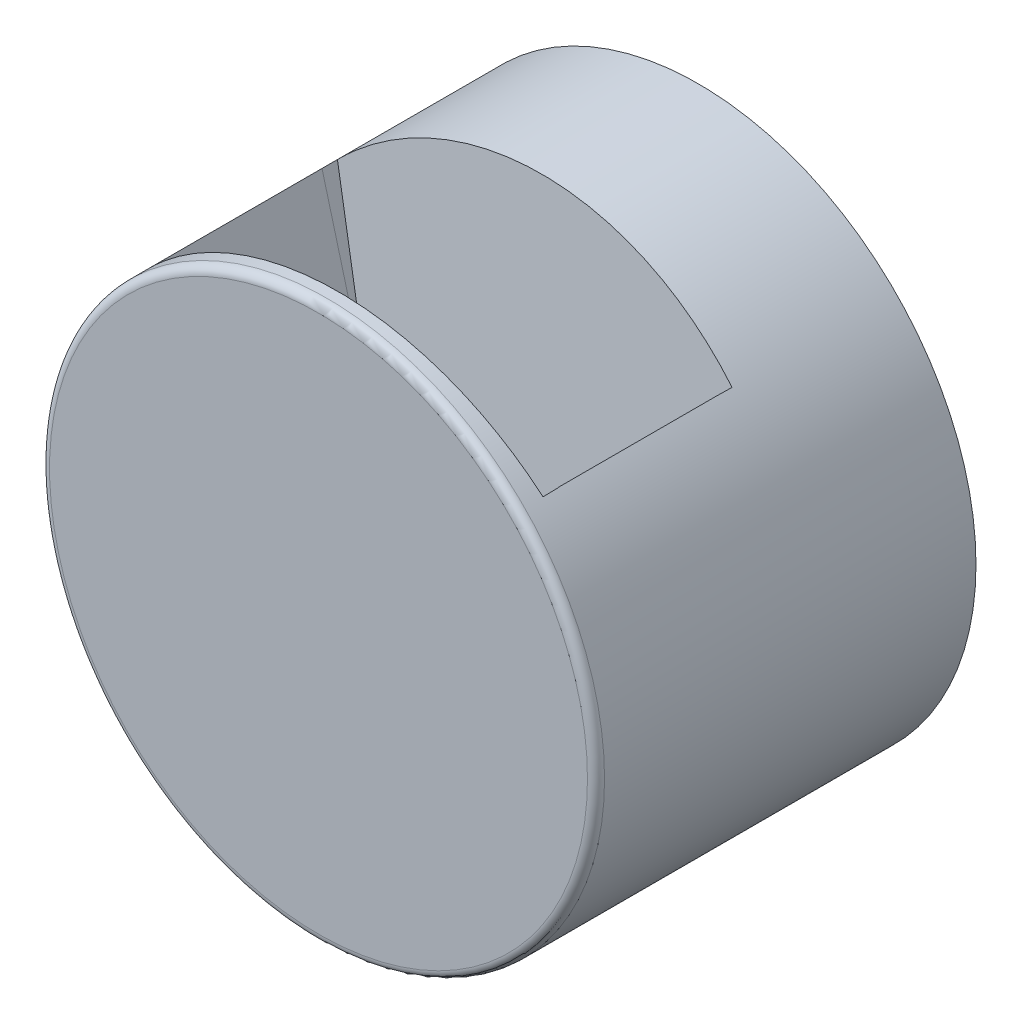
ISO-10303-21;
HEADER;
FILE_DESCRIPTION(('STEP AP214'),'2;1');
FILE_NAME('part.step','',(''),(''),'','','');
FILE_SCHEMA(('AUTOMOTIVE_DESIGN { 1 0 10303 214 1 1 1 1 }'));
ENDSEC;
DATA;
#1=APPLICATION_CONTEXT('core data for automotive mechanical design processes');
#2=APPLICATION_PROTOCOL_DEFINITION('international standard','automotive_design',2000,#1);
#3=PRODUCT_CONTEXT('',#1,'mechanical');
#4=PRODUCT('Part','Part','',(#3));
#5=PRODUCT_RELATED_PRODUCT_CATEGORY('part','',(#4));
#6=PRODUCT_DEFINITION_FORMATION('','',#4);
#7=PRODUCT_DEFINITION_CONTEXT('part definition',#1,'design');
#8=PRODUCT_DEFINITION('design','',#6,#7);
#9=PRODUCT_DEFINITION_SHAPE('','',#8);
#10=(LENGTH_UNIT() NAMED_UNIT(*) SI_UNIT(.MILLI.,.METRE.));
#11=(NAMED_UNIT(*) PLANE_ANGLE_UNIT() SI_UNIT($,.RADIAN.));
#12=(NAMED_UNIT(*) SI_UNIT($,.STERADIAN.) SOLID_ANGLE_UNIT());
#13=UNCERTAINTY_MEASURE_WITH_UNIT(LENGTH_MEASURE(1.E-05),#10,'distance_accuracy_value','');
#14=(GEOMETRIC_REPRESENTATION_CONTEXT(3) GLOBAL_UNCERTAINTY_ASSIGNED_CONTEXT((#13)) GLOBAL_UNIT_ASSIGNED_CONTEXT((#10,
#11,#12)) REPRESENTATION_CONTEXT('',''));
#15=CARTESIAN_POINT('',(0.,0.,0.));
#16=DIRECTION('',(0.,0.,1.));
#17=DIRECTION('',(1.,0.,0.));
#18=AXIS2_PLACEMENT_3D('',#15,#16,#17);
#19=CARTESIAN_POINT('',(0.,0.,-58.9238815542512));
#20=DIRECTION('',(0.,0.,1.));
#21=DIRECTION('',(1.,0.,0.));
#22=AXIS2_PLACEMENT_3D('',#19,#20,#21);
#23=CYLINDRICAL_SURFACE('',#22,30.5);
#24=DIRECTION('',(0.,0.,-1.));
#25=VECTOR('',#24,1.);
#26=CARTESIAN_POINT('',(-30.3644067796611,2.87276885935403,54.75));
#27=LINE('',#26,#25);
#28=CARTESIAN_POINT('',(-30.364406779661,2.87276885935404,35.));
#29=VERTEX_POINT('',#28);
#30=CARTESIAN_POINT('',(-30.364406779661,2.8727688593541,54.1272311406459));
#31=VERTEX_POINT('',#30);
#32=EDGE_CURVE('E191',#29,#31,#27,.F.);
#33=ORIENTED_EDGE('',*,*,#32,.F.);
#34=CARTESIAN_POINT('',(0.,0.,35.));
#35=DIRECTION('',(0.,0.,-1.));
#36=DIRECTION('',(-1.,0.,0.));
#37=AXIS2_PLACEMENT_3D('',#34,#35,#36);
#38=CIRCLE('',#37,30.5);
#39=CARTESIAN_POINT('',(-2.8727688593545,30.364406779661,35.));
#40=VERTEX_POINT('',#39);
#41=EDGE_CURVE('E179',#29,#40,#38,.T.);
#42=ORIENTED_EDGE('',*,*,#41,.T.);
#43=DIRECTION('',(0.,0.,-1.));
#44=VECTOR('',#43,1.);
#45=CARTESIAN_POINT('',(-2.8727688593545,30.364406779661,42.));
#46=LINE('',#45,#44);
#47=CARTESIAN_POINT('',(-2.8727688593545,30.364406779661,51.));
#48=VERTEX_POINT('',#47);
#49=EDGE_CURVE('E189',#48,#40,#46,.T.);
#50=ORIENTED_EDGE('',*,*,#49,.F.);
#51=CARTESIAN_POINT('',(0.,0.,51.));
#52=DIRECTION('',(0.,0.,-1.));
#53=DIRECTION('',(-1.,0.,0.));
#54=AXIS2_PLACEMENT_3D('',#51,#52,#53);
#55=CIRCLE('',#54,30.5);
#56=CARTESIAN_POINT('',(-29.9040131086114,6.00000000000002,51.));
#57=VERTEX_POINT('',#56);
#58=EDGE_CURVE('E243',#57,#48,#55,.T.);
#59=ORIENTED_EDGE('',*,*,#58,.F.);
#60=CARTESIAN_POINT('',(0.,0.,57.));
#61=DIRECTION('',(0.,-0.707106781186549,-0.707106781186546));
#62=DIRECTION('',(0.,-0.707106781186546,0.707106781186549));
#63=AXIS2_PLACEMENT_3D('',#60,#61,#62);
#64=ELLIPSE('',#63,43.1335136523795,30.5);
#65=EDGE_CURVE('E388',#57,#31,#64,.F.);
#66=ORIENTED_EDGE('',*,*,#65,.T.);
#67=EDGE_LOOP('',(#33,#42,#50,#59,#66));
#68=FACE_BOUND('',#67,.T.);
#69=ADVANCED_FACE('F51',(#68),#23,.F.);
#70=DIRECTION('',(0.,0.,-1.));
#71=VECTOR('',#70,1.);
#72=CARTESIAN_POINT('',(-2.87276885935434,-30.364406779661,54.75));
#73=LINE('',#72,#71);
#74=CARTESIAN_POINT('',(-2.87276885935432,-30.364406779661,35.));
#75=VERTEX_POINT('',#74);
#76=CARTESIAN_POINT('',(-2.8727688593543,-30.364406779661,76.5));
#77=VERTEX_POINT('',#76);
#78=EDGE_CURVE('E235',#75,#77,#73,.F.);
#79=ORIENTED_EDGE('',*,*,#78,.F.);
#80=CARTESIAN_POINT('',(0.,0.,35.));
#81=DIRECTION('',(0.,0.,-1.));
#82=DIRECTION('',(-1.,0.,0.));
#83=AXIS2_PLACEMENT_3D('',#80,#81,#82);
#84=CIRCLE('',#83,30.5);
#85=CARTESIAN_POINT('',(-30.364406779661,-2.87276885935466,35.));
#86=VERTEX_POINT('',#85);
#87=EDGE_CURVE('E441',#75,#86,#84,.T.);
#88=ORIENTED_EDGE('',*,*,#87,.T.);
#89=DIRECTION('',(0.,0.,-1.));
#90=VECTOR('',#89,1.);
#91=CARTESIAN_POINT('',(-30.364406779661,-2.87276885935466,54.75));
#92=LINE('',#91,#90);
#93=CARTESIAN_POINT('',(-30.364406779661,-2.87276885935462,76.5));
#94=VERTEX_POINT('',#93);
#95=EDGE_CURVE('E213',#94,#86,#92,.T.);
#96=ORIENTED_EDGE('',*,*,#95,.F.);
#97=CARTESIAN_POINT('',(0.,0.,76.5));
#98=DIRECTION('',(0.,0.,-1.));
#99=DIRECTION('',(-1.,0.,0.));
#100=AXIS2_PLACEMENT_3D('',#97,#98,#99);
#101=CIRCLE('',#100,30.5);
#102=EDGE_CURVE('E377',#77,#94,#101,.T.);
#103=ORIENTED_EDGE('',*,*,#102,.F.);
#104=EDGE_LOOP('',(#79,#88,#96,#103));
#105=FACE_BOUND('',#104,.T.);
#106=ADVANCED_FACE('F440',(#105),#23,.F.);
#107=DIRECTION('',(0.,0.,-1.));
#108=VECTOR('',#107,1.);
#109=CARTESIAN_POINT('',(2.8727688593545,30.364406779661,42.));
#110=LINE('',#109,#108);
#111=CARTESIAN_POINT('',(2.8727688593545,30.364406779661,35.));
#112=VERTEX_POINT('',#111);
#113=CARTESIAN_POINT('',(2.87276885935449,30.364406779661,51.));
#114=VERTEX_POINT('',#113);
#115=EDGE_CURVE('E74',#112,#114,#110,.F.);
#116=ORIENTED_EDGE('',*,*,#115,.F.);
#117=CARTESIAN_POINT('',(0.,0.,35.));
#118=DIRECTION('',(0.,0.,-1.));
#119=DIRECTION('',(-1.,0.,0.));
#120=AXIS2_PLACEMENT_3D('',#117,#118,#119);
#121=CIRCLE('',#120,30.5);
#122=CARTESIAN_POINT('',(30.364406779661,2.87276885935447,35.));
#123=VERTEX_POINT('',#122);
#124=EDGE_CURVE('E68',#112,#123,#121,.T.);
#125=ORIENTED_EDGE('',*,*,#124,.T.);
#126=DIRECTION('',(0.,0.,-1.));
#127=VECTOR('',#126,1.);
#128=CARTESIAN_POINT('',(30.364406779661,2.87276885935445,54.75));
#129=LINE('',#128,#127);
#130=CARTESIAN_POINT('',(30.364406779661,2.87276885935452,54.1272311406455));
#131=VERTEX_POINT('',#130);
#132=EDGE_CURVE('E224',#131,#123,#129,.T.);
#133=ORIENTED_EDGE('',*,*,#132,.F.);
#134=CARTESIAN_POINT('',(0.,0.,57.));
#135=DIRECTION('',(0.,-0.707106781186549,-0.707106781186546));
#136=DIRECTION('',(0.,-0.707106781186546,0.707106781186549));
#137=AXIS2_PLACEMENT_3D('',#134,#135,#136);
#138=ELLIPSE('',#137,43.1335136523795,30.5);
#139=CARTESIAN_POINT('',(29.9040131086114,6.00000000000002,51.));
#140=VERTEX_POINT('',#139);
#141=EDGE_CURVE('E391',#131,#140,#138,.F.);
#142=ORIENTED_EDGE('',*,*,#141,.T.);
#143=EDGE_CURVE('E242',#114,#140,#55,.T.);
#144=ORIENTED_EDGE('',*,*,#143,.F.);
#145=EDGE_LOOP('',(#116,#125,#133,#142,#144));
#146=FACE_BOUND('',#145,.T.);
#147=ADVANCED_FACE('F423',(#146),#23,.F.);
#148=DIRECTION('',(0.,0.,-1.));
#149=VECTOR('',#148,1.);
#150=CARTESIAN_POINT('',(30.364406779661,-2.87276885935424,54.75));
#151=LINE('',#150,#149);
#152=CARTESIAN_POINT('',(30.364406779661,-2.87276885935424,35.));
#153=VERTEX_POINT('',#152);
#154=CARTESIAN_POINT('',(30.364406779661,-2.8727688593542,76.5));
#155=VERTEX_POINT('',#154);
#156=EDGE_CURVE('E228',#153,#155,#151,.F.);
#157=ORIENTED_EDGE('',*,*,#156,.F.);
#158=CARTESIAN_POINT('',(0.,0.,35.));
#159=DIRECTION('',(0.,0.,-1.));
#160=DIRECTION('',(-1.,0.,0.));
#161=AXIS2_PLACEMENT_3D('',#158,#159,#160);
#162=CIRCLE('',#161,30.5);
#163=CARTESIAN_POINT('',(2.87276885935434,-30.364406779661,35.));
#164=VERTEX_POINT('',#163);
#165=EDGE_CURVE('E445',#153,#164,#162,.T.);
#166=ORIENTED_EDGE('',*,*,#165,.T.);
#167=DIRECTION('',(0.,0.,-1.));
#168=VECTOR('',#167,1.);
#169=CARTESIAN_POINT('',(2.87276885935434,-30.364406779661,54.75));
#170=LINE('',#169,#168);
#171=CARTESIAN_POINT('',(2.87276885935434,-30.364406779661,76.5));
#172=VERTEX_POINT('',#171);
#173=EDGE_CURVE('E238',#172,#164,#170,.T.);
#174=ORIENTED_EDGE('',*,*,#173,.F.);
#175=EDGE_CURVE('E378',#155,#172,#101,.T.);
#176=ORIENTED_EDGE('',*,*,#175,.F.);
#177=EDGE_LOOP('',(#157,#166,#174,#176));
#178=FACE_BOUND('',#177,.T.);
#179=ADVANCED_FACE('F499',(#178),#23,.F.);
#180=CARTESIAN_POINT('',(0.,0.,79.5));
#181=DIRECTION('',(0.,0.,-1.));
#182=DIRECTION('',(-1.,0.,0.));
#183=AXIS2_PLACEMENT_3D('',#180,#181,#182);
#184=CYLINDRICAL_SURFACE('',#183,32.5);
#185=CARTESIAN_POINT('',(0.,0.,74.5));
#186=DIRECTION('',(0.,0.,1.));
#187=DIRECTION('',(1.,0.,0.));
#188=AXIS2_PLACEMENT_3D('',#185,#186,#187);
#189=CIRCLE('',#188,32.5);
#190=CARTESIAN_POINT('',(23.1087477699305,22.8524785637298,74.5));
#191=VERTEX_POINT('',#190);
#192=CARTESIAN_POINT('',(23.0919522595668,22.869449946203,74.5));
#193=VERTEX_POINT('',#192);
#194=EDGE_CURVE('E264',#191,#193,#189,.T.);
#195=ORIENTED_EDGE('',*,*,#194,.F.);
#196=CARTESIAN_POINT('',(23.1091884967737,22.8520328859509,74.2051689217905));
#197=CARTESIAN_POINT('',(23.1083053693488,22.8529250230236,74.4999524941342));
#198=CARTESIAN_POINT('',(23.1087474431071,22.852478798899,74.7947439777645));
#199=CARTESIAN_POINT('',(23.1122715764263,22.848915061626,75.3842475822815));
#200=CARTESIAN_POINT('',(23.1153532110199,22.8457979784839,75.6789597083047));
#201=CARTESIAN_POINT('',(23.1241457633643,22.8368982488406,76.2683037845672));
#202=CARTESIAN_POINT('',(23.1298566761139,22.8311156074094,76.562935734958));
#203=CARTESIAN_POINT('',(23.1438827228232,22.8168968579742,77.152121138897));
#204=CARTESIAN_POINT('',(23.1521982759032,22.8084603229233,77.4466745721708));
#205=CARTESIAN_POINT('',(23.1618026932539,22.7987038227785,77.7411418603045));
#206=B_SPLINE_CURVE_WITH_KNOTS('',3,(#196,#197,#198,#199,#200,#201,#202,#203,#204,#205),
.UNSPECIFIED.,.F.,.F.,(4,2,2,2,4),(0.,0.884352579249783,1.7685628051589,2.65277134925508,
3.53712224711771),.UNSPECIFIED.);
#207=CARTESIAN_POINT('',(23.1255746744655,22.8354504220021,76.3228657113816));
#208=VERTEX_POINT('',#207);
#209=EDGE_CURVE('E269',#191,#208,#206,.T.);
#210=ORIENTED_EDGE('',*,*,#209,.T.);
#211=CARTESIAN_POINT('',(0.,0.,74.3250226729482));
#212=DIRECTION('',(0.,-0.0871557427476584,0.996194698091746));
#213=DIRECTION('',(0.,-0.996194698091746,-0.0871557427476584));
#214=AXIS2_PLACEMENT_3D('',#211,#212,#213);
#215=ELLIPSE('',#214,32.6241447201588,32.5);
#216=CARTESIAN_POINT('',(-23.1255746744655,22.8354504220021,76.3228657113816));
#217=VERTEX_POINT('',#216);
#218=EDGE_CURVE('E265',#208,#217,#215,.T.);
#219=ORIENTED_EDGE('',*,*,#218,.T.);
#220=CARTESIAN_POINT('',(-23.1618026932539,22.7987038227785,77.7411418603045));
#221=CARTESIAN_POINT('',(-23.1521982759032,22.8084603229233,77.4466745721708));
#222=CARTESIAN_POINT('',(-23.1438827228232,22.8168968579742,77.152121138897));
#223=CARTESIAN_POINT('',(-23.1298566761139,22.8311156074094,76.562935734958));
#224=CARTESIAN_POINT('',(-23.1241457633643,22.8368982488406,76.2683037845672));
#225=CARTESIAN_POINT('',(-23.1153532110199,22.8457979784839,75.6789597083047));
#226=CARTESIAN_POINT('',(-23.1122715764263,22.848915061626,75.3842475822814));
#227=CARTESIAN_POINT('',(-23.1087474431071,22.852478798899,74.7947439777645));
#228=CARTESIAN_POINT('',(-23.1083053693488,22.8529250230236,74.4999524941342));
#229=CARTESIAN_POINT('',(-23.1091884967737,22.8520328859509,74.2051689217905));
#230=B_SPLINE_CURVE_WITH_KNOTS('',3,(#220,#221,#222,#223,#224,#225,#226,#227,#228,#229),
.UNSPECIFIED.,.F.,.F.,(4,2,2,2,4),(0.,0.884350897862625,1.76855944195881,2.65276966786795,
3.53712224711772),.UNSPECIFIED.);
#231=CARTESIAN_POINT('',(-23.1087477699305,22.8524785637298,74.5));
#232=VERTEX_POINT('',#231);
#233=EDGE_CURVE('E279',#217,#232,#230,.T.);
#234=ORIENTED_EDGE('',*,*,#233,.T.);
#235=CARTESIAN_POINT('',(-23.0919522595668,22.869449946203,74.5));
#236=VERTEX_POINT('',#235);
#237=EDGE_CURVE('E261',#236,#232,#189,.T.);
#238=ORIENTED_EDGE('',*,*,#237,.F.);
#239=DIRECTION('',(0.,0.,-1.));
#240=VECTOR('',#239,1.);
#241=CARTESIAN_POINT('',(-23.0919522595668,22.869449946203,79.5));
#242=LINE('',#241,#240);
#243=CARTESIAN_POINT('',(-23.0919522595668,22.869449946203,56.));
#244=VERTEX_POINT('',#243);
#245=EDGE_CURVE('E341',#236,#244,#242,.T.);
#246=ORIENTED_EDGE('',*,*,#245,.T.);
#247=CARTESIAN_POINT('',(-23.0923707499736,22.8690273764706,56.2877999592159));
#248=CARTESIAN_POINT('',(-23.0915322934497,22.8698731865769,56.0000567486308));
#249=CARTESIAN_POINT('',(-23.0919519276062,22.8694501956792,55.7123062385011));
#250=CARTESIAN_POINT('',(-23.0952979659406,22.8660715272666,55.1368784287956));
#251=CARTESIAN_POINT('',(-23.0982239887038,22.8631162351094,54.8492011247421));
#252=CARTESIAN_POINT('',(-23.1065731362478,22.8546781412833,54.2739204426149));
#253=CARTESIAN_POINT('',(-23.1119962567506,22.8491953439444,53.9863170644154));
#254=CARTESIAN_POINT('',(-23.1253169228091,22.8357132138679,53.4111827564704));
#255=CARTESIAN_POINT('',(-23.1332148447818,22.8277134983067,53.1236518444097));
#256=CARTESIAN_POINT('',(-23.1423379990589,22.8184616470374,52.8362004486257));
#257=B_SPLINE_CURVE_WITH_KNOTS('',3,(#247,#248,#249,#250,#251,#252,#253,#254,#255,#256),
.UNSPECIFIED.,.F.,.F.,(4,2,2,2,4),(0.,0.863231355651001,1.7263313707219,2.58942990712489,
3.45265978447007),.UNSPECIFIED.);
#258=CARTESIAN_POINT('',(-23.1087477699305,22.8524785637298,54.1756445192563));
#259=VERTEX_POINT('',#258);
#260=EDGE_CURVE('E312',#244,#259,#257,.T.);
#261=ORIENTED_EDGE('',*,*,#260,.T.);
#262=CARTESIAN_POINT('',(0.,0.,56.1749773270518));
#263=DIRECTION('',(0.,0.0871557427476583,0.996194698091745));
#264=DIRECTION('',(0.,0.996194698091746,-0.0871557427476584));
#265=AXIS2_PLACEMENT_3D('',#262,#263,#264);
#266=ELLIPSE('',#265,32.6241447201588,32.5);
#267=CARTESIAN_POINT('',(23.1087477699305,22.8524785637298,54.1756445192563));
#268=VERTEX_POINT('',#267);
#269=EDGE_CURVE('E330',#268,#259,#266,.T.);
#270=ORIENTED_EDGE('',*,*,#269,.F.);
#271=CARTESIAN_POINT('',(23.1423379990589,22.8184616470374,52.8362004486257));
#272=CARTESIAN_POINT('',(23.1332148447818,22.8277134983067,53.1236518444097));
#273=CARTESIAN_POINT('',(23.1253169228091,22.8357132138679,53.4111827564704));
#274=CARTESIAN_POINT('',(23.1119962567506,22.8491953439444,53.9863170644154));
#275=CARTESIAN_POINT('',(23.1065731362479,22.8546781412833,54.2739204426149));
#276=CARTESIAN_POINT('',(23.0982239887038,22.8631162351094,54.8492011247421));
#277=CARTESIAN_POINT('',(23.0952979659406,22.8660715272666,55.1368784287956));
#278=CARTESIAN_POINT('',(23.0919519276062,22.8694501956792,55.7123062385011));
#279=CARTESIAN_POINT('',(23.0915322934497,22.8698731865769,56.0000567486308));
#280=CARTESIAN_POINT('',(23.0923707499736,22.8690273764706,56.2877999592159));
#281=B_SPLINE_CURVE_WITH_KNOTS('',3,(#271,#272,#273,#274,#275,#276,#277,#278,#279,#280),
.UNSPECIFIED.,.F.,.F.,(4,2,2,2,4),(0.,0.863229877345195,1.72632841374817,2.58942842881907,
3.45265978447006),.UNSPECIFIED.);
#282=CARTESIAN_POINT('',(23.0919522595668,22.869449946203,56.));
#283=VERTEX_POINT('',#282);
#284=EDGE_CURVE('E321',#268,#283,#281,.T.);
#285=ORIENTED_EDGE('',*,*,#284,.T.);
#286=DIRECTION('',(0.,0.,-1.));
#287=VECTOR('',#286,1.);
#288=CARTESIAN_POINT('',(23.0919522595668,22.869449946203,79.5));
#289=LINE('',#288,#287);
#290=EDGE_CURVE('E353',#193,#283,#289,.T.);
#291=ORIENTED_EDGE('',*,*,#290,.F.);
#292=EDGE_LOOP('',(#195,#210,#219,#234,#238,#246,#261,#270,#285,#291));
#293=FACE_BOUND('',#292,.T.);
#294=CARTESIAN_POINT('',(0.,0.,78.5));
#295=DIRECTION('',(0.,0.,1.));
#296=DIRECTION('',(1.,0.,0.));
#297=AXIS2_PLACEMENT_3D('',#294,#295,#296);
#298=CIRCLE('',#297,32.5);
#299=CARTESIAN_POINT('',(32.5,0.,78.5));
#300=VERTEX_POINT('',#299);
#301=EDGE_CURVE('E399',#300,#300,#298,.F.);
#302=ORIENTED_EDGE('',*,*,#301,.T.);
#303=EDGE_LOOP('',(#302));
#304=FACE_BOUND('',#303,.T.);
#305=CARTESIAN_POINT('',(0.,0.,35.));
#306=DIRECTION('',(0.,0.,-1.));
#307=DIRECTION('',(-1.,0.,0.));
#308=AXIS2_PLACEMENT_3D('',#305,#306,#307);
#309=CIRCLE('',#308,32.5);
#310=CARTESIAN_POINT('',(-32.5,0.,35.));
#311=VERTEX_POINT('',#310);
#312=EDGE_CURVE('E449',#311,#311,#309,.T.);
#313=ORIENTED_EDGE('',*,*,#312,.F.);
#314=EDGE_LOOP('',(#313));
#315=FACE_BOUND('',#314,.T.);
#316=ADVANCED_FACE('F286',(#293,#304,#315),#184,.T.);
#317=CARTESIAN_POINT('',(0.,-29.5,84.9852813742386));
#318=DIRECTION('',(0.,0.,-1.));
#319=DIRECTION('',(-1.,0.,0.));
#320=AXIS2_PLACEMENT_3D('',#317,#318,#319);
#321=CYLINDRICAL_SURFACE('',#320,3.);
#322=ORIENTED_EDGE('',*,*,#173,.T.);
#323=CARTESIAN_POINT('',(0.,-29.5,35.));
#324=DIRECTION('',(0.,0.,-1.));
#325=DIRECTION('',(-1.,0.,0.));
#326=AXIS2_PLACEMENT_3D('',#323,#324,#325);
#327=CIRCLE('',#326,3.);
#328=EDGE_CURVE('E444',#164,#75,#327,.F.);
#329=ORIENTED_EDGE('',*,*,#328,.T.);
#330=ORIENTED_EDGE('',*,*,#78,.T.);
#331=CARTESIAN_POINT('',(0.,-29.5,76.5));
#332=DIRECTION('',(0.,0.,1.));
#333=DIRECTION('',(1.,0.,0.));
#334=AXIS2_PLACEMENT_3D('',#331,#332,#333);
#335=CIRCLE('',#334,3.);
#336=EDGE_CURVE('E231',#77,#172,#335,.F.);
#337=ORIENTED_EDGE('',*,*,#336,.T.);
#338=EDGE_LOOP('',(#322,#329,#330,#337));
#339=FACE_BOUND('',#338,.T.);
#340=ADVANCED_FACE('F502',(#339),#321,.T.);
#341=CARTESIAN_POINT('',(29.5,1.02998699495872E-13,84.9852813742386));
#342=DIRECTION('',(0.,0.,-1.));
#343=DIRECTION('',(-1.,0.,0.));
#344=AXIS2_PLACEMENT_3D('',#341,#342,#343);
#345=CYLINDRICAL_SURFACE('',#344,3.);
#346=ORIENTED_EDGE('',*,*,#132,.T.);
#347=CARTESIAN_POINT('',(29.5,1.02998699495872E-13,35.));
#348=DIRECTION('',(0.,0.,-1.));
#349=DIRECTION('',(-1.,0.,0.));
#350=AXIS2_PLACEMENT_3D('',#347,#348,#349);
#351=CIRCLE('',#350,3.);
#352=EDGE_CURVE('E452',#123,#153,#351,.F.);
#353=ORIENTED_EDGE('',*,*,#352,.T.);
#354=ORIENTED_EDGE('',*,*,#156,.T.);
#355=CARTESIAN_POINT('',(29.5,1.02998699495872E-13,76.5));
#356=DIRECTION('',(0.,0.,1.));
#357=DIRECTION('',(1.,0.,0.));
#358=AXIS2_PLACEMENT_3D('',#355,#356,#357);
#359=CIRCLE('',#358,3.);
#360=CARTESIAN_POINT('',(27.2639320225001,2.,76.5));
#361=VERTEX_POINT('',#360);
#362=EDGE_CURVE('E217',#155,#361,#359,.F.);
#363=ORIENTED_EDGE('',*,*,#362,.T.);
#364=DIRECTION('',(0.,0.,-1.));
#365=VECTOR('',#364,1.);
#366=CARTESIAN_POINT('',(27.2639320225001,2.,84.9852813742386));
#367=LINE('',#366,#365);
#368=CARTESIAN_POINT('',(27.2639320225001,2.,55.));
#369=VERTEX_POINT('',#368);
#370=EDGE_CURVE('E221',#369,#361,#367,.F.);
#371=ORIENTED_EDGE('',*,*,#370,.F.);
#372=CARTESIAN_POINT('',(29.5,1.02998699495872E-13,56.9999999999999));
#373=DIRECTION('',(0.,-0.707106781186549,-0.707106781186546));
#374=DIRECTION('',(0.,0.707106781186546,-0.707106781186549));
#375=AXIS2_PLACEMENT_3D('',#372,#373,#374);
#376=ELLIPSE('',#375,4.24264068711929,3.);
#377=EDGE_CURVE('E403',#369,#131,#376,.T.);
#378=ORIENTED_EDGE('',*,*,#377,.T.);
#379=EDGE_LOOP('',(#346,#353,#354,#363,#371,#378));
#380=FACE_BOUND('',#379,.T.);
#381=ADVANCED_FACE('F426',(#380),#345,.T.);
#382=CARTESIAN_POINT('',(-29.5,-3.08996098487617E-13,84.9852813742386));
#383=DIRECTION('',(0.,0.,-1.));
#384=DIRECTION('',(-1.,0.,0.));
#385=AXIS2_PLACEMENT_3D('',#382,#383,#384);
#386=CYLINDRICAL_SURFACE('',#385,3.);
#387=ORIENTED_EDGE('',*,*,#95,.T.);
#388=CARTESIAN_POINT('',(-29.5,-3.08996098487617E-13,35.));
#389=DIRECTION('',(0.,0.,-1.));
#390=DIRECTION('',(-1.,0.,0.));
#391=AXIS2_PLACEMENT_3D('',#388,#389,#390);
#392=CIRCLE('',#391,3.);
#393=EDGE_CURVE('E193',#86,#29,#392,.F.);
#394=ORIENTED_EDGE('',*,*,#393,.T.);
#395=ORIENTED_EDGE('',*,*,#32,.T.);
#396=CARTESIAN_POINT('',(-29.5,-3.08996098487617E-13,57.0000000000003));
#397=DIRECTION('',(0.,-0.707106781186549,-0.707106781186546));
#398=DIRECTION('',(0.,0.707106781186546,-0.707106781186549));
#399=AXIS2_PLACEMENT_3D('',#396,#397,#398);
#400=ELLIPSE('',#399,4.24264068711929,3.);
#401=CARTESIAN_POINT('',(-27.2639320225005,2.,55.));
#402=VERTEX_POINT('',#401);
#403=EDGE_CURVE('E61',#31,#402,#400,.T.);
#404=ORIENTED_EDGE('',*,*,#403,.T.);
#405=DIRECTION('',(0.,0.,-1.));
#406=VECTOR('',#405,1.);
#407=CARTESIAN_POINT('',(-27.2639320225005,2.,84.9852813742386));
#408=LINE('',#407,#406);
#409=CARTESIAN_POINT('',(-27.2639320225005,2.,76.5));
#410=VERTEX_POINT('',#409);
#411=EDGE_CURVE('E202',#410,#402,#408,.T.);
#412=ORIENTED_EDGE('',*,*,#411,.F.);
#413=CARTESIAN_POINT('',(-29.5,-3.08996098487617E-13,76.5));
#414=DIRECTION('',(0.,0.,1.));
#415=DIRECTION('',(1.,0.,0.));
#416=AXIS2_PLACEMENT_3D('',#413,#414,#415);
#417=CIRCLE('',#416,3.);
#418=EDGE_CURVE('E197',#410,#94,#417,.F.);
#419=ORIENTED_EDGE('',*,*,#418,.T.);
#420=EDGE_LOOP('',(#387,#394,#395,#404,#412,#419));
#421=FACE_BOUND('',#420,.T.);
#422=ADVANCED_FACE('F412',(#421),#386,.T.);
#423=CARTESIAN_POINT('',(0.,29.4999999999998,59.4852813742392));
#424=DIRECTION('',(0.,0.,-1.));
#425=DIRECTION('',(-1.,0.,0.));
#426=AXIS2_PLACEMENT_3D('',#423,#424,#425);
#427=CYLINDRICAL_SURFACE('',#426,3.0000000000002);
#428=ORIENTED_EDGE('',*,*,#49,.T.);
#429=CARTESIAN_POINT('',(0.,29.4999999999998,35.));
#430=DIRECTION('',(0.,0.,-1.));
#431=DIRECTION('',(-1.,0.,0.));
#432=AXIS2_PLACEMENT_3D('',#429,#430,#431);
#433=CIRCLE('',#432,3.0000000000002);
#434=EDGE_CURVE('E175',#40,#112,#433,.F.);
#435=ORIENTED_EDGE('',*,*,#434,.T.);
#436=ORIENTED_EDGE('',*,*,#115,.T.);
#437=CARTESIAN_POINT('',(0.,29.4999999999998,51.));
#438=DIRECTION('',(0.,0.,-1.));
#439=DIRECTION('',(-1.,0.,0.));
#440=AXIS2_PLACEMENT_3D('',#437,#438,#439);
#441=CIRCLE('',#440,3.0000000000002);
#442=EDGE_CURVE('E13',#114,#48,#441,.T.);
#443=ORIENTED_EDGE('',*,*,#442,.T.);
#444=EDGE_LOOP('',(#428,#435,#436,#443));
#445=FACE_BOUND('',#444,.T.);
#446=ADVANCED_FACE('F195',(#445),#427,.T.);
#447=CARTESIAN_POINT('',(0.,0.,76.5));
#448=DIRECTION('',(0.,0.,1.));
#449=DIRECTION('',(1.,0.,0.));
#450=AXIS2_PLACEMENT_3D('',#447,#448,#449);
#451=PLANE('',#450);
#452=ORIENTED_EDGE('',*,*,#102,.T.);
#453=ORIENTED_EDGE('',*,*,#418,.F.);
#454=DIRECTION('',(-1.,0.,0.));
#455=VECTOR('',#454,1.);
#456=CARTESIAN_POINT('',(-21.8071404050034,2.,76.5));
#457=LINE('',#456,#455);
#458=EDGE_CURVE('E357',#361,#410,#457,.T.);
#459=ORIENTED_EDGE('',*,*,#458,.F.);
#460=ORIENTED_EDGE('',*,*,#362,.F.);
#461=ORIENTED_EDGE('',*,*,#175,.T.);
#462=ORIENTED_EDGE('',*,*,#336,.F.);
#463=EDGE_LOOP('',(#452,#453,#459,#460,#461,#462));
#464=FACE_BOUND('',#463,.T.);
#465=ADVANCED_FACE('F433',(#464),#451,.F.);
#466=CARTESIAN_POINT('',(0.,0.,79.5));
#467=DIRECTION('',(0.,0.,1.));
#468=DIRECTION('',(1.,0.,0.));
#469=AXIS2_PLACEMENT_3D('',#466,#467,#468);
#470=PLANE('',#469);
#471=CARTESIAN_POINT('',(0.,0.,79.5));
#472=DIRECTION('',(0.,0.,1.));
#473=DIRECTION('',(1.,0.,0.));
#474=AXIS2_PLACEMENT_3D('',#471,#472,#473);
#475=CIRCLE('',#474,31.5);
#476=CARTESIAN_POINT('',(31.5,0.,79.5));
#477=VERTEX_POINT('',#476);
#478=EDGE_CURVE('E395',#477,#477,#475,.T.);
#479=ORIENTED_EDGE('',*,*,#478,.T.);
#480=EDGE_LOOP('',(#479));
#481=FACE_BOUND('',#480,.T.);
#482=ADVANCED_FACE('F644',(#481),#470,.T.);
#483=CARTESIAN_POINT('',(0.,2.,0.));
#484=DIRECTION('',(0.,1.,0.));
#485=DIRECTION('',(0.,0.,1.));
#486=AXIS2_PLACEMENT_3D('',#483,#484,#485);
#487=PLANE('',#486);
#488=DIRECTION('',(0.,0.,1.));
#489=VECTOR('',#488,1.);
#490=CARTESIAN_POINT('',(-17.5,2.,56.));
#491=LINE('',#490,#489);
#492=CARTESIAN_POINT('',(-17.5,2.,56.));
#493=VERTEX_POINT('',#492);
#494=CARTESIAN_POINT('',(-17.5,2.,74.5));
#495=VERTEX_POINT('',#494);
#496=EDGE_CURVE('E373',#493,#495,#491,.T.);
#497=ORIENTED_EDGE('',*,*,#496,.T.);
#498=DIRECTION('',(1.,0.,0.));
#499=VECTOR('',#498,1.);
#500=CARTESIAN_POINT('',(17.5,2.,74.5));
#501=LINE('',#500,#499);
#502=CARTESIAN_POINT('',(17.5,2.,74.5));
#503=VERTEX_POINT('',#502);
#504=EDGE_CURVE('E369',#495,#503,#501,.T.);
#505=ORIENTED_EDGE('',*,*,#504,.T.);
#506=DIRECTION('',(0.,0.,-1.));
#507=VECTOR('',#506,1.);
#508=CARTESIAN_POINT('',(17.5,2.,56.));
#509=LINE('',#508,#507);
#510=CARTESIAN_POINT('',(17.5,2.,56.));
#511=VERTEX_POINT('',#510);
#512=EDGE_CURVE('E365',#503,#511,#509,.T.);
#513=ORIENTED_EDGE('',*,*,#512,.T.);
#514=DIRECTION('',(-1.,0.,0.));
#515=VECTOR('',#514,1.);
#516=CARTESIAN_POINT('',(17.5,2.,56.));
#517=LINE('',#516,#515);
#518=EDGE_CURVE('E361',#511,#493,#517,.T.);
#519=ORIENTED_EDGE('',*,*,#518,.T.);
#520=EDGE_LOOP('',(#497,#505,#513,#519));
#521=FACE_BOUND('',#520,.T.);
#522=ORIENTED_EDGE('',*,*,#458,.T.);
#523=ORIENTED_EDGE('',*,*,#411,.T.);
#524=DIRECTION('',(1.,0.,0.));
#525=VECTOR('',#524,1.);
#526=CARTESIAN_POINT('',(30.4343555870664,2.,55.));
#527=LINE('',#526,#525);
#528=EDGE_CURVE('E385',#402,#369,#527,.T.);
#529=ORIENTED_EDGE('',*,*,#528,.T.);
#530=ORIENTED_EDGE('',*,*,#370,.T.);
#531=EDGE_LOOP('',(#522,#523,#529,#530));
#532=FACE_BOUND('',#531,.T.);
#533=ADVANCED_FACE('F430',(#521,#532),#487,.F.);
#534=CARTESIAN_POINT('',(16.9823619097949,0.0681483474218635,0.));
#535=DIRECTION('',(-0.965925826289068,0.258819045102521,0.));
#536=DIRECTION('',(0.,0.,1.));
#537=AXIS2_PLACEMENT_3D('',#534,#535,#536);
#538=PLANE('',#537);
#539=ORIENTED_EDGE('',*,*,#290,.T.);
#540=DIRECTION('',(-0.258819045102521,-0.965925826289068,0.));
#541=VECTOR('',#540,1.);
#542=CARTESIAN_POINT('',(17.5,2.,56.));
#543=LINE('',#542,#541);
#544=EDGE_CURVE('E349',#283,#511,#543,.T.);
#545=ORIENTED_EDGE('',*,*,#544,.T.);
#546=ORIENTED_EDGE('',*,*,#512,.F.);
#547=DIRECTION('',(0.258819045102521,0.965925826289068,0.));
#548=VECTOR('',#547,1.);
#549=CARTESIAN_POINT('',(17.5,2.,74.5));
#550=LINE('',#549,#548);
#551=EDGE_CURVE('E345',#503,#193,#550,.T.);
#552=ORIENTED_EDGE('',*,*,#551,.T.);
#553=EDGE_LOOP('',(#539,#545,#546,#552));
#554=FACE_BOUND('',#553,.T.);
#555=ADVANCED_FACE('F643',(#554),#538,.T.);
#556=CARTESIAN_POINT('',(-16.9823619097949,0.0681483474218635,0.));
#557=DIRECTION('',(-0.965925826289068,-0.258819045102521,0.));
#558=DIRECTION('',(0.,0.,1.));
#559=AXIS2_PLACEMENT_3D('',#556,#557,#558);
#560=PLANE('',#559);
#561=DIRECTION('',(0.258819045102521,-0.965925826289068,0.));
#562=VECTOR('',#561,1.);
#563=CARTESIAN_POINT('',(-17.5,2.,74.5));
#564=LINE('',#563,#562);
#565=EDGE_CURVE('E333',#236,#495,#564,.T.);
#566=ORIENTED_EDGE('',*,*,#565,.T.);
#567=ORIENTED_EDGE('',*,*,#496,.F.);
#568=DIRECTION('',(-0.258819045102521,0.965925826289068,0.));
#569=VECTOR('',#568,1.);
#570=CARTESIAN_POINT('',(-17.5,2.,56.));
#571=LINE('',#570,#569);
#572=EDGE_CURVE('E337',#493,#244,#571,.T.);
#573=ORIENTED_EDGE('',*,*,#572,.T.);
#574=ORIENTED_EDGE('',*,*,#245,.F.);
#575=EDGE_LOOP('',(#566,#567,#573,#574));
#576=FACE_BOUND('',#575,.T.);
#577=ADVANCED_FACE('F302',(#576),#560,.F.);
#578=CARTESIAN_POINT('',(0.,0.00761060381650712,56.1743114854953));
#579=DIRECTION('',(0.,0.0871557427476583,0.996194698091745));
#580=DIRECTION('',(1.,0.,0.));
#581=AXIS2_PLACEMENT_3D('',#578,#579,#580);
#582=PLANE('',#581);
#583=ORIENTED_EDGE('',*,*,#269,.T.);
#584=DIRECTION('',(0.258819045102521,-0.962250186899058,0.0841859828293694));
#585=VECTOR('',#584,1.);
#586=CARTESIAN_POINT('',(-17.5,2.,56.));
#587=LINE('',#586,#585);
#588=EDGE_CURVE('E749',#259,#493,#587,.T.);
#589=ORIENTED_EDGE('',*,*,#588,.T.);
#590=ORIENTED_EDGE('',*,*,#518,.F.);
#591=DIRECTION('',(0.258819045102521,0.962250186899058,-0.0841859828293694));
#592=VECTOR('',#591,1.);
#593=CARTESIAN_POINT('',(17.5,2.,56.));
#594=LINE('',#593,#592);
#595=EDGE_CURVE('E322',#511,#268,#594,.T.);
#596=ORIENTED_EDGE('',*,*,#595,.T.);
#597=EDGE_LOOP('',(#583,#589,#590,#596));
#598=FACE_BOUND('',#597,.T.);
#599=ADVANCED_FACE('F298',(#598),#582,.T.);
#600=CARTESIAN_POINT('',(17.5,2.,56.));
#601=DIRECTION('',(1.,0.,0.));
#602=DIRECTION('',(0.,1.,0.));
#603=AXIS2_PLACEMENT_3D('',#600,#601,#602);
#604=CONICAL_SURFACE('',#603,0.,1.30899693899575);
#605=ORIENTED_EDGE('',*,*,#595,.F.);
#606=ORIENTED_EDGE('',*,*,#544,.F.);
#607=ORIENTED_EDGE('',*,*,#284,.F.);
#608=EDGE_LOOP('',(#605,#606,#607));
#609=FACE_BOUND('',#608,.T.);
#610=ADVANCED_FACE('F301',(#609),#604,.T.);
#611=CARTESIAN_POINT('',(-26.3418931886368,2.,56.));
#612=DIRECTION('',(-1.,0.,0.));
#613=DIRECTION('',(0.,-1.,0.));
#614=AXIS2_PLACEMENT_3D('',#611,#612,#613);
#615=CONICAL_SURFACE('',#614,32.9983946150897,1.30899693899575);
#616=ORIENTED_EDGE('',*,*,#572,.F.);
#617=ORIENTED_EDGE('',*,*,#588,.F.);
#618=ORIENTED_EDGE('',*,*,#260,.F.);
#619=EDGE_LOOP('',(#616,#617,#618));
#620=FACE_BOUND('',#619,.T.);
#621=ADVANCED_FACE('F304',(#620),#615,.T.);
#622=CARTESIAN_POINT('',(-17.5,2.,74.5));
#623=DIRECTION('',(-1.,0.,0.));
#624=DIRECTION('',(0.,-1.,0.));
#625=AXIS2_PLACEMENT_3D('',#622,#623,#624);
#626=CONICAL_SURFACE('',#625,0.,1.30804222419305);
#627=DIRECTION('',(-0.25974111069287,0.962003590310748,0.084164408423428));
#628=VECTOR('',#627,1.);
#629=CARTESIAN_POINT('',(-17.5,2.,74.5));
#630=LINE('',#629,#628);
#631=EDGE_CURVE('E254',#495,#217,#630,.T.);
#632=ORIENTED_EDGE('',*,*,#631,.F.);
#633=DIRECTION('',(-0.25974111069287,0.965678287741851,0.));
#634=VECTOR('',#633,1.);
#635=CARTESIAN_POINT('',(-17.5,2.,74.5));
#636=LINE('',#635,#634);
#637=EDGE_CURVE('E246',#495,#232,#636,.T.);
#638=ORIENTED_EDGE('',*,*,#637,.T.);
#639=ORIENTED_EDGE('',*,*,#233,.F.);
#640=EDGE_LOOP('',(#632,#638,#639));
#641=FACE_BOUND('',#640,.T.);
#642=ADVANCED_FACE('F294',(#641),#626,.T.);
#643=CARTESIAN_POINT('',(26.5926562584228,2.,74.5));
#644=DIRECTION('',(1.,0.,0.));
#645=DIRECTION('',(0.,1.,0.));
#646=AXIS2_PLACEMENT_3D('',#643,#644,#645);
#647=CONICAL_SURFACE('',#646,33.8051250463831,1.30804222419304);
#648=DIRECTION('',(-0.259741110692871,-0.965678287741851,0.));
#649=VECTOR('',#648,1.);
#650=CARTESIAN_POINT('',(17.5,2.,74.5));
#651=LINE('',#650,#649);
#652=EDGE_CURVE('E250',#191,#503,#651,.T.);
#653=ORIENTED_EDGE('',*,*,#652,.T.);
#654=DIRECTION('',(-0.259741110692871,-0.962003590310748,-0.084164408423428));
#655=VECTOR('',#654,1.);
#656=CARTESIAN_POINT('',(17.5,2.,74.5));
#657=LINE('',#656,#655);
#658=EDGE_CURVE('E258',#208,#503,#657,.T.);
#659=ORIENTED_EDGE('',*,*,#658,.F.);
#660=ORIENTED_EDGE('',*,*,#209,.F.);
#661=EDGE_LOOP('',(#653,#659,#660));
#662=FACE_BOUND('',#661,.T.);
#663=ADVANCED_FACE('F289',(#662),#647,.T.);
#664=CARTESIAN_POINT('',(0.,0.00761060381650885,74.3256885145047));
#665=DIRECTION('',(0.,-0.0871557427476584,0.996194698091746));
#666=DIRECTION('',(1.,0.,0.));
#667=AXIS2_PLACEMENT_3D('',#664,#665,#666);
#668=PLANE('',#667);
#669=ORIENTED_EDGE('',*,*,#658,.T.);
#670=ORIENTED_EDGE('',*,*,#504,.F.);
#671=ORIENTED_EDGE('',*,*,#631,.T.);
#672=ORIENTED_EDGE('',*,*,#218,.F.);
#673=EDGE_LOOP('',(#669,#670,#671,#672));
#674=FACE_BOUND('',#673,.T.);
#675=ADVANCED_FACE('F293',(#674),#668,.F.);
#676=CARTESIAN_POINT('',(0.,0.,74.5));
#677=DIRECTION('',(0.,0.,1.));
#678=DIRECTION('',(1.,0.,0.));
#679=AXIS2_PLACEMENT_3D('',#676,#677,#678);
#680=PLANE('',#679);
#681=ORIENTED_EDGE('',*,*,#194,.T.);
#682=ORIENTED_EDGE('',*,*,#551,.F.);
#683=ORIENTED_EDGE('',*,*,#652,.F.);
#684=EDGE_LOOP('',(#681,#682,#683));
#685=FACE_BOUND('',#684,.T.);
#686=ADVANCED_FACE('F679',(#685),#680,.T.);
#687=ORIENTED_EDGE('',*,*,#237,.T.);
#688=ORIENTED_EDGE('',*,*,#637,.F.);
#689=ORIENTED_EDGE('',*,*,#565,.F.);
#690=EDGE_LOOP('',(#687,#688,#689));
#691=FACE_BOUND('',#690,.T.);
#692=ADVANCED_FACE('F630',(#691),#680,.T.);
#693=CARTESIAN_POINT('',(0.,0.,51.));
#694=DIRECTION('',(0.,0.,-1.));
#695=DIRECTION('',(-1.,0.,0.));
#696=AXIS2_PLACEMENT_3D('',#693,#694,#695);
#697=PLANE('',#696);
#698=ORIENTED_EDGE('',*,*,#442,.F.);
#699=ORIENTED_EDGE('',*,*,#143,.T.);
#700=DIRECTION('',(-1.,0.,0.));
#701=VECTOR('',#700,1.);
#702=CARTESIAN_POINT('',(-30.4343555870664,6.00000000000002,51.));
#703=LINE('',#702,#701);
#704=EDGE_CURVE('E381',#140,#57,#703,.T.);
#705=ORIENTED_EDGE('',*,*,#704,.T.);
#706=ORIENTED_EDGE('',*,*,#58,.T.);
#707=EDGE_LOOP('',(#698,#699,#705,#706));
#708=FACE_BOUND('',#707,.T.);
#709=ADVANCED_FACE('F418',(#708),#697,.T.);
#710=CARTESIAN_POINT('',(0.,6.00000000000002,51.));
#711=DIRECTION('',(0.,-0.707106781186549,-0.707106781186546));
#712=DIRECTION('',(1.,0.,0.));
#713=AXIS2_PLACEMENT_3D('',#710,#711,#712);
#714=PLANE('',#713);
#715=ORIENTED_EDGE('',*,*,#403,.F.);
#716=ORIENTED_EDGE('',*,*,#65,.F.);
#717=ORIENTED_EDGE('',*,*,#704,.F.);
#718=ORIENTED_EDGE('',*,*,#141,.F.);
#719=ORIENTED_EDGE('',*,*,#377,.F.);
#720=ORIENTED_EDGE('',*,*,#528,.F.);
#721=EDGE_LOOP('',(#715,#716,#717,#718,#719,#720));
#722=FACE_BOUND('',#721,.T.);
#723=ADVANCED_FACE('F414',(#722),#714,.T.);
#724=CARTESIAN_POINT('',(0.,0.,78.5));
#725=DIRECTION('',(0.,0.,1.));
#726=DIRECTION('',(1.,0.,0.));
#727=AXIS2_PLACEMENT_3D('',#724,#725,#726);
#728=TOROIDAL_SURFACE('',#727,31.5,1.);
#729=ORIENTED_EDGE('',*,*,#301,.F.);
#730=EDGE_LOOP('',(#729));
#731=FACE_BOUND('',#730,.T.);
#732=ORIENTED_EDGE('',*,*,#478,.F.);
#733=EDGE_LOOP('',(#732));
#734=FACE_BOUND('',#733,.T.);
#735=ADVANCED_FACE('F53',(#731,#734),#728,.T.);
#736=CARTESIAN_POINT('',(0.,0.,35.));
#737=DIRECTION('',(0.,0.,-1.));
#738=DIRECTION('',(-1.,0.,0.));
#739=AXIS2_PLACEMENT_3D('',#736,#737,#738);
#740=PLANE('',#739);
#741=CARTESIAN_POINT('',(29.5,1.02998699495872E-13,35.));
#742=DIRECTION('',(0.,0.,-1.));
#743=DIRECTION('',(-1.,0.,0.));
#744=AXIS2_PLACEMENT_3D('',#741,#742,#743);
#745=CIRCLE('',#744,0.950000000000001);
#746=CARTESIAN_POINT('',(28.55,1.02998699495872E-13,35.));
#747=VERTEX_POINT('',#746);
#748=EDGE_CURVE('E183',#747,#747,#745,.F.);
#749=ORIENTED_EDGE('',*,*,#748,.T.);
#750=EDGE_LOOP('',(#749));
#751=FACE_BOUND('',#750,.T.);
#752=CARTESIAN_POINT('',(0.,29.4999999999998,35.));
#753=DIRECTION('',(0.,0.,-1.));
#754=DIRECTION('',(-1.,0.,0.));
#755=AXIS2_PLACEMENT_3D('',#752,#753,#754);
#756=CIRCLE('',#755,0.95);
#757=CARTESIAN_POINT('',(-0.95,29.4999999999998,35.));
#758=VERTEX_POINT('',#757);
#759=EDGE_CURVE('E485',#758,#758,#756,.F.);
#760=ORIENTED_EDGE('',*,*,#759,.T.);
#761=EDGE_LOOP('',(#760));
#762=FACE_BOUND('',#761,.T.);
#763=CARTESIAN_POINT('',(-29.5,-3.08996098487617E-13,35.));
#764=DIRECTION('',(0.,0.,-1.));
#765=DIRECTION('',(-1.,0.,0.));
#766=AXIS2_PLACEMENT_3D('',#763,#764,#765);
#767=CIRCLE('',#766,0.950000000000001);
#768=CARTESIAN_POINT('',(-30.45,-3.08996098487617E-13,35.));
#769=VERTEX_POINT('',#768);
#770=EDGE_CURVE('E489',#769,#769,#767,.F.);
#771=ORIENTED_EDGE('',*,*,#770,.T.);
#772=EDGE_LOOP('',(#771));
#773=FACE_BOUND('',#772,.T.);
#774=CARTESIAN_POINT('',(0.,-29.5,35.));
#775=DIRECTION('',(0.,0.,-1.));
#776=DIRECTION('',(-1.,0.,0.));
#777=AXIS2_PLACEMENT_3D('',#774,#775,#776);
#778=CIRCLE('',#777,0.95);
#779=CARTESIAN_POINT('',(-0.95,-29.5,35.));
#780=VERTEX_POINT('',#779);
#781=EDGE_CURVE('E55',#780,#780,#778,.F.);
#782=ORIENTED_EDGE('',*,*,#781,.T.);
#783=EDGE_LOOP('',(#782));
#784=FACE_BOUND('',#783,.T.);
#785=ORIENTED_EDGE('',*,*,#165,.F.);
#786=ORIENTED_EDGE('',*,*,#352,.F.);
#787=ORIENTED_EDGE('',*,*,#124,.F.);
#788=ORIENTED_EDGE('',*,*,#434,.F.);
#789=ORIENTED_EDGE('',*,*,#41,.F.);
#790=ORIENTED_EDGE('',*,*,#393,.F.);
#791=ORIENTED_EDGE('',*,*,#87,.F.);
#792=ORIENTED_EDGE('',*,*,#328,.F.);
#793=EDGE_LOOP('',(#785,#786,#787,#788,#789,#790,#791,#792));
#794=FACE_BOUND('',#793,.T.);
#795=ORIENTED_EDGE('',*,*,#312,.T.);
#796=EDGE_LOOP('',(#795));
#797=FACE_BOUND('',#796,.T.);
#798=ADVANCED_FACE('F177',(#751,#762,#773,#784,#794,#797),#740,.T.);
#799=CARTESIAN_POINT('',(-29.5,-3.08996098487617E-13,43.));
#800=DIRECTION('',(0.,0.,-1.));
#801=DIRECTION('',(-1.,0.,0.));
#802=AXIS2_PLACEMENT_3D('',#799,#800,#801);
#803=PLANE('',#802);
#804=CARTESIAN_POINT('',(-29.5,-3.08996098487617E-13,43.));
#805=DIRECTION('',(0.,0.,-1.));
#806=DIRECTION('',(-1.,0.,0.));
#807=AXIS2_PLACEMENT_3D('',#804,#805,#806);
#808=CIRCLE('',#807,0.950000000000001);
#809=CARTESIAN_POINT('',(-30.45,-3.08996098487617E-13,43.));
#810=VERTEX_POINT('',#809);
#811=EDGE_CURVE('E463',#810,#810,#808,.T.);
#812=ORIENTED_EDGE('',*,*,#811,.T.);
#813=EDGE_LOOP('',(#812));
#814=FACE_BOUND('',#813,.T.);
#815=ADVANCED_FACE('F546',(#814),#803,.T.);
#816=CARTESIAN_POINT('',(-29.5,-3.08996098487617E-13,43.));
#817=DIRECTION('',(0.,0.,-1.));
#818=DIRECTION('',(-1.,0.,0.));
#819=AXIS2_PLACEMENT_3D('',#816,#817,#818);
#820=CYLINDRICAL_SURFACE('',#819,0.950000000000001);
#821=ORIENTED_EDGE('',*,*,#811,.F.);
#822=EDGE_LOOP('',(#821));
#823=FACE_BOUND('',#822,.T.);
#824=ORIENTED_EDGE('',*,*,#770,.F.);
#825=EDGE_LOOP('',(#824));
#826=FACE_BOUND('',#825,.T.);
#827=ADVANCED_FACE('F556',(#823,#826),#820,.F.);
#828=CARTESIAN_POINT('',(0.,29.4999999999998,43.));
#829=DIRECTION('',(0.,0.,-1.));
#830=DIRECTION('',(-1.,0.,0.));
#831=AXIS2_PLACEMENT_3D('',#828,#829,#830);
#832=PLANE('',#831);
#833=CARTESIAN_POINT('',(0.,29.4999999999998,43.));
#834=DIRECTION('',(0.,0.,-1.));
#835=DIRECTION('',(-1.,0.,0.));
#836=AXIS2_PLACEMENT_3D('',#833,#834,#835);
#837=CIRCLE('',#836,0.95);
#838=CARTESIAN_POINT('',(-0.95,29.4999999999998,43.));
#839=VERTEX_POINT('',#838);
#840=EDGE_CURVE('E467',#839,#839,#837,.T.);
#841=ORIENTED_EDGE('',*,*,#840,.T.);
#842=EDGE_LOOP('',(#841));
#843=FACE_BOUND('',#842,.T.);
#844=ADVANCED_FACE('F561',(#843),#832,.T.);
#845=CARTESIAN_POINT('',(0.,29.4999999999998,43.));
#846=DIRECTION('',(0.,0.,-1.));
#847=DIRECTION('',(-1.,0.,0.));
#848=AXIS2_PLACEMENT_3D('',#845,#846,#847);
#849=CYLINDRICAL_SURFACE('',#848,0.95);
#850=ORIENTED_EDGE('',*,*,#840,.F.);
#851=EDGE_LOOP('',(#850));
#852=FACE_BOUND('',#851,.T.);
#853=ORIENTED_EDGE('',*,*,#759,.F.);
#854=EDGE_LOOP('',(#853));
#855=FACE_BOUND('',#854,.T.);
#856=ADVANCED_FACE('F570',(#852,#855),#849,.F.);
#857=CARTESIAN_POINT('',(29.5,1.02998699495872E-13,43.));
#858=DIRECTION('',(0.,0.,-1.));
#859=DIRECTION('',(-1.,0.,0.));
#860=AXIS2_PLACEMENT_3D('',#857,#858,#859);
#861=PLANE('',#860);
#862=CARTESIAN_POINT('',(29.5,1.02998699495872E-13,43.));
#863=DIRECTION('',(0.,0.,-1.));
#864=DIRECTION('',(-1.,0.,0.));
#865=AXIS2_PLACEMENT_3D('',#862,#863,#864);
#866=CIRCLE('',#865,0.950000000000001);
#867=CARTESIAN_POINT('',(28.55,1.02998699495872E-13,43.));
#868=VERTEX_POINT('',#867);
#869=EDGE_CURVE('E459',#868,#868,#866,.T.);
#870=ORIENTED_EDGE('',*,*,#869,.T.);
#871=EDGE_LOOP('',(#870));
#872=FACE_BOUND('',#871,.T.);
#873=ADVANCED_FACE('F474',(#872),#861,.T.);
#874=CARTESIAN_POINT('',(29.5,1.02998699495872E-13,43.));
#875=DIRECTION('',(0.,0.,-1.));
#876=DIRECTION('',(-1.,0.,0.));
#877=AXIS2_PLACEMENT_3D('',#874,#875,#876);
#878=CYLINDRICAL_SURFACE('',#877,0.950000000000001);
#879=ORIENTED_EDGE('',*,*,#869,.F.);
#880=EDGE_LOOP('',(#879));
#881=FACE_BOUND('',#880,.T.);
#882=ORIENTED_EDGE('',*,*,#748,.F.);
#883=EDGE_LOOP('',(#882));
#884=FACE_BOUND('',#883,.T.);
#885=ADVANCED_FACE('F476',(#881,#884),#878,.F.);
#886=CARTESIAN_POINT('',(0.,-29.5,43.));
#887=DIRECTION('',(0.,0.,-1.));
#888=DIRECTION('',(-1.,0.,0.));
#889=AXIS2_PLACEMENT_3D('',#886,#887,#888);
#890=PLANE('',#889);
#891=CARTESIAN_POINT('',(0.,-29.5,43.));
#892=DIRECTION('',(0.,0.,-1.));
#893=DIRECTION('',(-1.,0.,0.));
#894=AXIS2_PLACEMENT_3D('',#891,#892,#893);
#895=CIRCLE('',#894,0.95);
#896=CARTESIAN_POINT('',(-0.95,-29.5,43.));
#897=VERTEX_POINT('',#896);
#898=EDGE_CURVE('E204',#897,#897,#895,.T.);
#899=ORIENTED_EDGE('',*,*,#898,.T.);
#900=EDGE_LOOP('',(#899));
#901=FACE_BOUND('',#900,.T.);
#902=ADVANCED_FACE('F479',(#901),#890,.T.);
#903=CARTESIAN_POINT('',(0.,-29.5,43.));
#904=DIRECTION('',(0.,0.,-1.));
#905=DIRECTION('',(-1.,0.,0.));
#906=AXIS2_PLACEMENT_3D('',#903,#904,#905);
#907=CYLINDRICAL_SURFACE('',#906,0.95);
#908=ORIENTED_EDGE('',*,*,#898,.F.);
#909=EDGE_LOOP('',(#908));
#910=FACE_BOUND('',#909,.T.);
#911=ORIENTED_EDGE('',*,*,#781,.F.);
#912=EDGE_LOOP('',(#911));
#913=FACE_BOUND('',#912,.T.);
#914=ADVANCED_FACE('F587',(#910,#913),#907,.F.);
#915=CLOSED_SHELL('',(#69,#106,#147,#179,#316,#340,#381,#422,#446,#465,#482,#533,#555,#577,#599,
#610,#621,#642,#663,#675,#686,#692,#709,#723,#735,#798,#815,#827,#844,#856,#873,#885,#902,#914));
#916=MANIFOLD_SOLID_BREP('B2',#915);
#917=ADVANCED_BREP_SHAPE_REPRESENTATION('',(#18,#916),#14);
#918=SHAPE_DEFINITION_REPRESENTATION(#9,#917);
ENDSEC;
END-ISO-10303-21;
